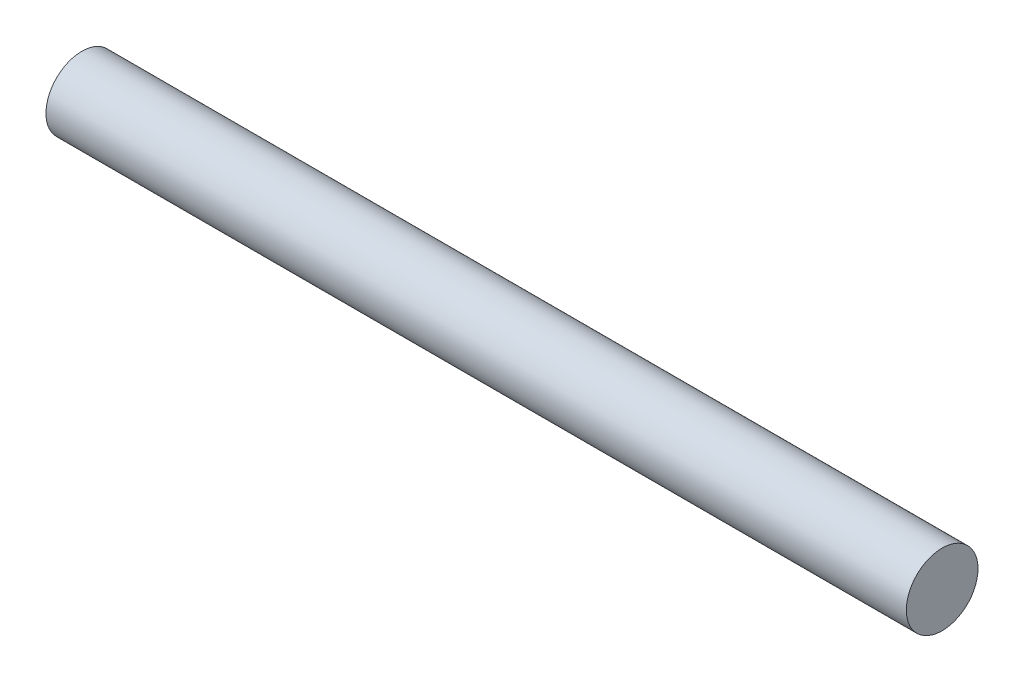
ISO-10303-21;
HEADER;
FILE_DESCRIPTION(('STEP AP214'),'2;1');
FILE_NAME('part.step','',(''),(''),'','','');
FILE_SCHEMA(('AUTOMOTIVE_DESIGN { 1 0 10303 214 1 1 1 1 }'));
ENDSEC;
DATA;
#1=APPLICATION_CONTEXT('core data for automotive mechanical design processes');
#2=APPLICATION_PROTOCOL_DEFINITION('international standard','automotive_design',2000,#1);
#3=PRODUCT_CONTEXT('',#1,'mechanical');
#4=PRODUCT('Part','Part','',(#3));
#5=PRODUCT_RELATED_PRODUCT_CATEGORY('part','',(#4));
#6=PRODUCT_DEFINITION_FORMATION('','',#4);
#7=PRODUCT_DEFINITION_CONTEXT('part definition',#1,'design');
#8=PRODUCT_DEFINITION('design','',#6,#7);
#9=PRODUCT_DEFINITION_SHAPE('','',#8);
#10=(LENGTH_UNIT() NAMED_UNIT(*) SI_UNIT(.MILLI.,.METRE.));
#11=(NAMED_UNIT(*) PLANE_ANGLE_UNIT() SI_UNIT($,.RADIAN.));
#12=(NAMED_UNIT(*) SI_UNIT($,.STERADIAN.) SOLID_ANGLE_UNIT());
#13=UNCERTAINTY_MEASURE_WITH_UNIT(LENGTH_MEASURE(1.E-05),#10,'distance_accuracy_value','');
#14=(GEOMETRIC_REPRESENTATION_CONTEXT(3) GLOBAL_UNCERTAINTY_ASSIGNED_CONTEXT((#13)) GLOBAL_UNIT_ASSIGNED_CONTEXT((#10,
#11,#12)) REPRESENTATION_CONTEXT('',''));
#15=CARTESIAN_POINT('',(0.,0.,0.));
#16=DIRECTION('',(0.,0.,1.));
#17=DIRECTION('',(1.,0.,0.));
#18=AXIS2_PLACEMENT_3D('',#15,#16,#17);
#19=CARTESIAN_POINT('',(38.1,0.,0.));
#20=DIRECTION('',(-1.,0.,0.));
#21=DIRECTION('',(0.,0.,1.));
#22=AXIS2_PLACEMENT_3D('',#19,#20,#21);
#23=CYLINDRICAL_SURFACE('',#22,1.5875);
#24=CARTESIAN_POINT('',(38.1,0.,0.));
#25=DIRECTION('',(1.,0.,0.));
#26=DIRECTION('',(0.,0.,-1.));
#27=AXIS2_PLACEMENT_3D('',#24,#25,#26);
#28=CIRCLE('',#27,1.5875);
#29=CARTESIAN_POINT('',(38.1,0.,-1.5875));
#30=VERTEX_POINT('',#29);
#31=EDGE_CURVE('E10',#30,#30,#28,.T.);
#32=ORIENTED_EDGE('',*,*,#31,.F.);
#33=EDGE_LOOP('',(#32));
#34=FACE_BOUND('',#33,.T.);
#35=CARTESIAN_POINT('',(0.,0.,0.));
#36=DIRECTION('',(1.,0.,0.));
#37=DIRECTION('',(0.,0.,-1.));
#38=AXIS2_PLACEMENT_3D('',#35,#36,#37);
#39=CIRCLE('',#38,1.5875);
#40=CARTESIAN_POINT('',(0.,0.,-1.5875));
#41=VERTEX_POINT('',#40);
#42=EDGE_CURVE('E34',#41,#41,#39,.T.);
#43=ORIENTED_EDGE('',*,*,#42,.T.);
#44=EDGE_LOOP('',(#43));
#45=FACE_BOUND('',#44,.T.);
#46=ADVANCED_FACE('F31',(#34,#45),#23,.T.);
#47=CARTESIAN_POINT('',(38.1,0.,0.));
#48=DIRECTION('',(1.,0.,0.));
#49=DIRECTION('',(0.,0.,-1.));
#50=AXIS2_PLACEMENT_3D('',#47,#48,#49);
#51=PLANE('',#50);
#52=ORIENTED_EDGE('',*,*,#31,.T.);
#53=EDGE_LOOP('',(#52));
#54=FACE_BOUND('',#53,.T.);
#55=ADVANCED_FACE('F46',(#54),#51,.T.);
#56=CARTESIAN_POINT('',(0.,0.,0.));
#57=DIRECTION('',(1.,0.,0.));
#58=DIRECTION('',(0.,0.,-1.));
#59=AXIS2_PLACEMENT_3D('',#56,#57,#58);
#60=PLANE('',#59);
#61=ORIENTED_EDGE('',*,*,#42,.F.);
#62=EDGE_LOOP('',(#61));
#63=FACE_BOUND('',#62,.T.);
#64=ADVANCED_FACE('F44',(#63),#60,.F.);
#65=CLOSED_SHELL('',(#46,#55,#64));
#66=MANIFOLD_SOLID_BREP('B2',#65);
#67=ADVANCED_BREP_SHAPE_REPRESENTATION('',(#18,#66),#14);
#68=SHAPE_DEFINITION_REPRESENTATION(#9,#67);
ENDSEC;
END-ISO-10303-21;
